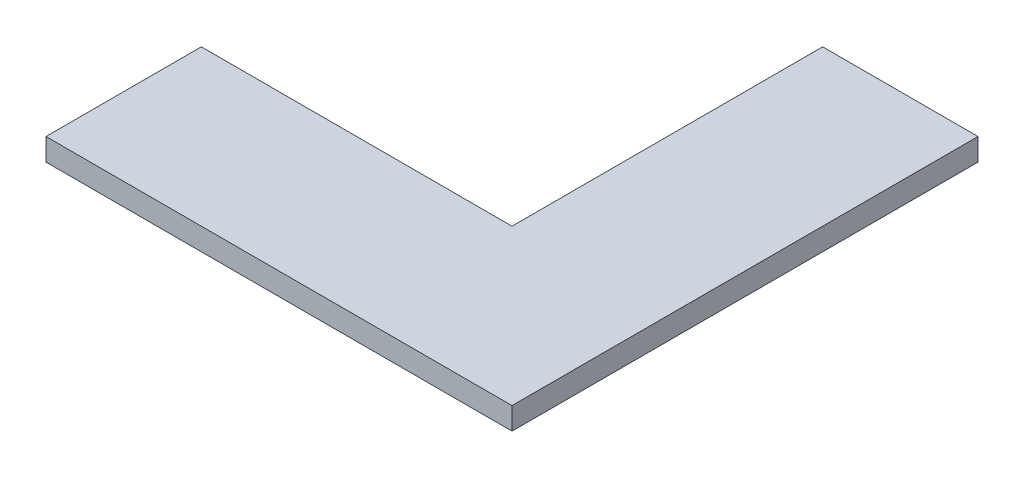
ISO-10303-21;
HEADER;
FILE_DESCRIPTION(('STEP AP214'),'2;1');
FILE_NAME('part.step','',(''),(''),'','','');
FILE_SCHEMA(('AUTOMOTIVE_DESIGN { 1 0 10303 214 1 1 1 1 }'));
ENDSEC;
DATA;
#1=APPLICATION_CONTEXT('core data for automotive mechanical design processes');
#2=APPLICATION_PROTOCOL_DEFINITION('international standard','automotive_design',2000,#1);
#3=PRODUCT_CONTEXT('',#1,'mechanical');
#4=PRODUCT('Part','Part','',(#3));
#5=PRODUCT_RELATED_PRODUCT_CATEGORY('part','',(#4));
#6=PRODUCT_DEFINITION_FORMATION('','',#4);
#7=PRODUCT_DEFINITION_CONTEXT('part definition',#1,'design');
#8=PRODUCT_DEFINITION('design','',#6,#7);
#9=PRODUCT_DEFINITION_SHAPE('','',#8);
#10=(LENGTH_UNIT() NAMED_UNIT(*) SI_UNIT(.MILLI.,.METRE.));
#11=(NAMED_UNIT(*) PLANE_ANGLE_UNIT() SI_UNIT($,.RADIAN.));
#12=(NAMED_UNIT(*) SI_UNIT($,.STERADIAN.) SOLID_ANGLE_UNIT());
#13=UNCERTAINTY_MEASURE_WITH_UNIT(LENGTH_MEASURE(1.E-05),#10,'distance_accuracy_value','');
#14=(GEOMETRIC_REPRESENTATION_CONTEXT(3) GLOBAL_UNCERTAINTY_ASSIGNED_CONTEXT((#13)) GLOBAL_UNIT_ASSIGNED_CONTEXT((#10,
#11,#12)) REPRESENTATION_CONTEXT('',''));
#15=CARTESIAN_POINT('',(0.,0.,0.));
#16=DIRECTION('',(0.,0.,1.));
#17=DIRECTION('',(1.,0.,0.));
#18=AXIS2_PLACEMENT_3D('',#15,#16,#17);
#19=CARTESIAN_POINT('',(105.,10.,105.));
#20=DIRECTION('',(0.,0.,-1.));
#21=DIRECTION('',(-1.,0.,0.));
#22=AXIS2_PLACEMENT_3D('',#19,#20,#21);
#23=PLANE('',#22);
#24=DIRECTION('',(1.,0.,0.));
#25=VECTOR('',#24,1.);
#26=CARTESIAN_POINT('',(105.,0.,105.));
#27=LINE('',#26,#25);
#28=CARTESIAN_POINT('',(-105.,0.,105.));
#29=VERTEX_POINT('',#28);
#30=CARTESIAN_POINT('',(105.,0.,105.));
#31=VERTEX_POINT('',#30);
#32=EDGE_CURVE('E118',#29,#31,#27,.T.);
#33=ORIENTED_EDGE('',*,*,#32,.T.);
#34=DIRECTION('',(0.,-1.,0.));
#35=VECTOR('',#34,1.);
#36=CARTESIAN_POINT('',(105.,10.,105.));
#37=LINE('',#36,#35);
#38=CARTESIAN_POINT('',(105.,10.,105.));
#39=VERTEX_POINT('',#38);
#40=EDGE_CURVE('E11',#39,#31,#37,.T.);
#41=ORIENTED_EDGE('',*,*,#40,.F.);
#42=DIRECTION('',(1.,0.,0.));
#43=VECTOR('',#42,1.);
#44=CARTESIAN_POINT('',(105.,10.,105.));
#45=LINE('',#44,#43);
#46=CARTESIAN_POINT('',(-105.,10.,105.));
#47=VERTEX_POINT('',#46);
#48=EDGE_CURVE('E128',#47,#39,#45,.T.);
#49=ORIENTED_EDGE('',*,*,#48,.F.);
#50=DIRECTION('',(0.,-1.,0.));
#51=VECTOR('',#50,1.);
#52=CARTESIAN_POINT('',(-105.,10.,105.));
#53=LINE('',#52,#51);
#54=EDGE_CURVE('E114',#47,#29,#53,.T.);
#55=ORIENTED_EDGE('',*,*,#54,.T.);
#56=EDGE_LOOP('',(#33,#41,#49,#55));
#57=FACE_BOUND('',#56,.T.);
#58=ADVANCED_FACE('F34',(#57),#23,.F.);
#59=CARTESIAN_POINT('',(105.,10.,-105.));
#60=DIRECTION('',(-1.,0.,0.));
#61=DIRECTION('',(0.,0.,1.));
#62=AXIS2_PLACEMENT_3D('',#59,#60,#61);
#63=PLANE('',#62);
#64=DIRECTION('',(0.,0.,-1.));
#65=VECTOR('',#64,1.);
#66=CARTESIAN_POINT('',(105.,0.,-105.));
#67=LINE('',#66,#65);
#68=CARTESIAN_POINT('',(105.,0.,-105.));
#69=VERTEX_POINT('',#68);
#70=EDGE_CURVE('E121',#31,#69,#67,.T.);
#71=ORIENTED_EDGE('',*,*,#70,.T.);
#72=DIRECTION('',(0.,-1.,0.));
#73=VECTOR('',#72,1.);
#74=CARTESIAN_POINT('',(105.,10.,-105.));
#75=LINE('',#74,#73);
#76=CARTESIAN_POINT('',(105.,10.,-105.));
#77=VERTEX_POINT('',#76);
#78=EDGE_CURVE('E42',#77,#69,#75,.T.);
#79=ORIENTED_EDGE('',*,*,#78,.F.);
#80=DIRECTION('',(0.,0.,-1.));
#81=VECTOR('',#80,1.);
#82=CARTESIAN_POINT('',(105.,10.,-105.));
#83=LINE('',#82,#81);
#84=EDGE_CURVE('E87',#39,#77,#83,.T.);
#85=ORIENTED_EDGE('',*,*,#84,.F.);
#86=ORIENTED_EDGE('',*,*,#40,.T.);
#87=EDGE_LOOP('',(#71,#79,#85,#86));
#88=FACE_BOUND('',#87,.T.);
#89=ADVANCED_FACE('F152',(#88),#63,.F.);
#90=CARTESIAN_POINT('',(35.,10.,-105.));
#91=DIRECTION('',(0.,0.,1.));
#92=DIRECTION('',(1.,0.,0.));
#93=AXIS2_PLACEMENT_3D('',#90,#91,#92);
#94=PLANE('',#93);
#95=DIRECTION('',(-1.,0.,0.));
#96=VECTOR('',#95,1.);
#97=CARTESIAN_POINT('',(35.,0.,-105.));
#98=LINE('',#97,#96);
#99=CARTESIAN_POINT('',(35.,0.,-105.));
#100=VERTEX_POINT('',#99);
#101=EDGE_CURVE('E123',#69,#100,#98,.T.);
#102=ORIENTED_EDGE('',*,*,#101,.T.);
#103=DIRECTION('',(0.,-1.,0.));
#104=VECTOR('',#103,1.);
#105=CARTESIAN_POINT('',(35.,10.,-105.));
#106=LINE('',#105,#104);
#107=CARTESIAN_POINT('',(35.,10.,-105.));
#108=VERTEX_POINT('',#107);
#109=EDGE_CURVE('E109',#108,#100,#106,.T.);
#110=ORIENTED_EDGE('',*,*,#109,.F.);
#111=DIRECTION('',(-1.,0.,0.));
#112=VECTOR('',#111,1.);
#113=CARTESIAN_POINT('',(35.,10.,-105.));
#114=LINE('',#113,#112);
#115=EDGE_CURVE('E100',#77,#108,#114,.T.);
#116=ORIENTED_EDGE('',*,*,#115,.F.);
#117=ORIENTED_EDGE('',*,*,#78,.T.);
#118=EDGE_LOOP('',(#102,#110,#116,#117));
#119=FACE_BOUND('',#118,.T.);
#120=ADVANCED_FACE('F134',(#119),#94,.F.);
#121=CARTESIAN_POINT('',(35.,10.,35.));
#122=DIRECTION('',(1.,0.,0.));
#123=DIRECTION('',(0.,0.,-1.));
#124=AXIS2_PLACEMENT_3D('',#121,#122,#123);
#125=PLANE('',#124);
#126=DIRECTION('',(0.,0.,1.));
#127=VECTOR('',#126,1.);
#128=CARTESIAN_POINT('',(35.,0.,35.));
#129=LINE('',#128,#127);
#130=CARTESIAN_POINT('',(35.,0.,35.));
#131=VERTEX_POINT('',#130);
#132=EDGE_CURVE('E108',#100,#131,#129,.T.);
#133=ORIENTED_EDGE('',*,*,#132,.T.);
#134=DIRECTION('',(0.,-1.,0.));
#135=VECTOR('',#134,1.);
#136=CARTESIAN_POINT('',(35.,10.,35.));
#137=LINE('',#136,#135);
#138=CARTESIAN_POINT('',(35.,10.,35.));
#139=VERTEX_POINT('',#138);
#140=EDGE_CURVE('E105',#139,#131,#137,.T.);
#141=ORIENTED_EDGE('',*,*,#140,.F.);
#142=DIRECTION('',(0.,0.,1.));
#143=VECTOR('',#142,1.);
#144=CARTESIAN_POINT('',(35.,10.,35.));
#145=LINE('',#144,#143);
#146=EDGE_CURVE('E94',#108,#139,#145,.T.);
#147=ORIENTED_EDGE('',*,*,#146,.F.);
#148=ORIENTED_EDGE('',*,*,#109,.T.);
#149=EDGE_LOOP('',(#133,#141,#147,#148));
#150=FACE_BOUND('',#149,.T.);
#151=ADVANCED_FACE('F106',(#150),#125,.F.);
#152=CARTESIAN_POINT('',(-105.,10.,35.));
#153=DIRECTION('',(0.,0.,1.));
#154=DIRECTION('',(1.,0.,0.));
#155=AXIS2_PLACEMENT_3D('',#152,#153,#154);
#156=PLANE('',#155);
#157=DIRECTION('',(-1.,0.,0.));
#158=VECTOR('',#157,1.);
#159=CARTESIAN_POINT('',(-105.,0.,35.));
#160=LINE('',#159,#158);
#161=CARTESIAN_POINT('',(-105.,0.,35.));
#162=VERTEX_POINT('',#161);
#163=EDGE_CURVE('E73',#131,#162,#160,.T.);
#164=ORIENTED_EDGE('',*,*,#163,.T.);
#165=DIRECTION('',(0.,-1.,0.));
#166=VECTOR('',#165,1.);
#167=CARTESIAN_POINT('',(-105.,10.,35.));
#168=LINE('',#167,#166);
#169=CARTESIAN_POINT('',(-105.,10.,35.));
#170=VERTEX_POINT('',#169);
#171=EDGE_CURVE('E110',#170,#162,#168,.T.);
#172=ORIENTED_EDGE('',*,*,#171,.F.);
#173=DIRECTION('',(-1.,0.,0.));
#174=VECTOR('',#173,1.);
#175=CARTESIAN_POINT('',(-105.,10.,35.));
#176=LINE('',#175,#174);
#177=EDGE_CURVE('E98',#139,#170,#176,.T.);
#178=ORIENTED_EDGE('',*,*,#177,.F.);
#179=ORIENTED_EDGE('',*,*,#140,.T.);
#180=EDGE_LOOP('',(#164,#172,#178,#179));
#181=FACE_BOUND('',#180,.T.);
#182=ADVANCED_FACE('F112',(#181),#156,.F.);
#183=CARTESIAN_POINT('',(-105.,10.,105.));
#184=DIRECTION('',(1.,0.,0.));
#185=DIRECTION('',(0.,0.,-1.));
#186=AXIS2_PLACEMENT_3D('',#183,#184,#185);
#187=PLANE('',#186);
#188=DIRECTION('',(0.,0.,1.));
#189=VECTOR('',#188,1.);
#190=CARTESIAN_POINT('',(-105.,0.,105.));
#191=LINE('',#190,#189);
#192=EDGE_CURVE('E79',#162,#29,#191,.T.);
#193=ORIENTED_EDGE('',*,*,#192,.T.);
#194=ORIENTED_EDGE('',*,*,#54,.F.);
#195=DIRECTION('',(0.,0.,1.));
#196=VECTOR('',#195,1.);
#197=CARTESIAN_POINT('',(-105.,10.,105.));
#198=LINE('',#197,#196);
#199=EDGE_CURVE('E50',#170,#47,#198,.T.);
#200=ORIENTED_EDGE('',*,*,#199,.F.);
#201=ORIENTED_EDGE('',*,*,#171,.T.);
#202=EDGE_LOOP('',(#193,#194,#200,#201));
#203=FACE_BOUND('',#202,.T.);
#204=ADVANCED_FACE('F141',(#203),#187,.F.);
#205=CARTESIAN_POINT('',(0.,10.,0.));
#206=DIRECTION('',(0.,-1.,0.));
#207=DIRECTION('',(0.,0.,-1.));
#208=AXIS2_PLACEMENT_3D('',#205,#206,#207);
#209=PLANE('',#208);
#210=ORIENTED_EDGE('',*,*,#48,.T.);
#211=ORIENTED_EDGE('',*,*,#84,.T.);
#212=ORIENTED_EDGE('',*,*,#115,.T.);
#213=ORIENTED_EDGE('',*,*,#146,.T.);
#214=ORIENTED_EDGE('',*,*,#177,.T.);
#215=ORIENTED_EDGE('',*,*,#199,.T.);
#216=EDGE_LOOP('',(#210,#211,#212,#213,#214,#215));
#217=FACE_BOUND('',#216,.T.);
#218=ADVANCED_FACE('F96',(#217),#209,.F.);
#219=CARTESIAN_POINT('',(0.,0.,0.));
#220=DIRECTION('',(0.,-1.,0.));
#221=DIRECTION('',(0.,0.,-1.));
#222=AXIS2_PLACEMENT_3D('',#219,#220,#221);
#223=PLANE('',#222);
#224=ORIENTED_EDGE('',*,*,#32,.F.);
#225=ORIENTED_EDGE('',*,*,#192,.F.);
#226=ORIENTED_EDGE('',*,*,#163,.F.);
#227=ORIENTED_EDGE('',*,*,#132,.F.);
#228=ORIENTED_EDGE('',*,*,#101,.F.);
#229=ORIENTED_EDGE('',*,*,#70,.F.);
#230=EDGE_LOOP('',(#224,#225,#226,#227,#228,#229));
#231=FACE_BOUND('',#230,.T.);
#232=ADVANCED_FACE('F137',(#231),#223,.T.);
#233=CLOSED_SHELL('',(#58,#89,#120,#151,#182,#204,#218,#232));
#234=MANIFOLD_SOLID_BREP('B2',#233);
#235=ADVANCED_BREP_SHAPE_REPRESENTATION('',(#18,#234),#14);
#236=SHAPE_DEFINITION_REPRESENTATION(#9,#235);
ENDSEC;
END-ISO-10303-21;
